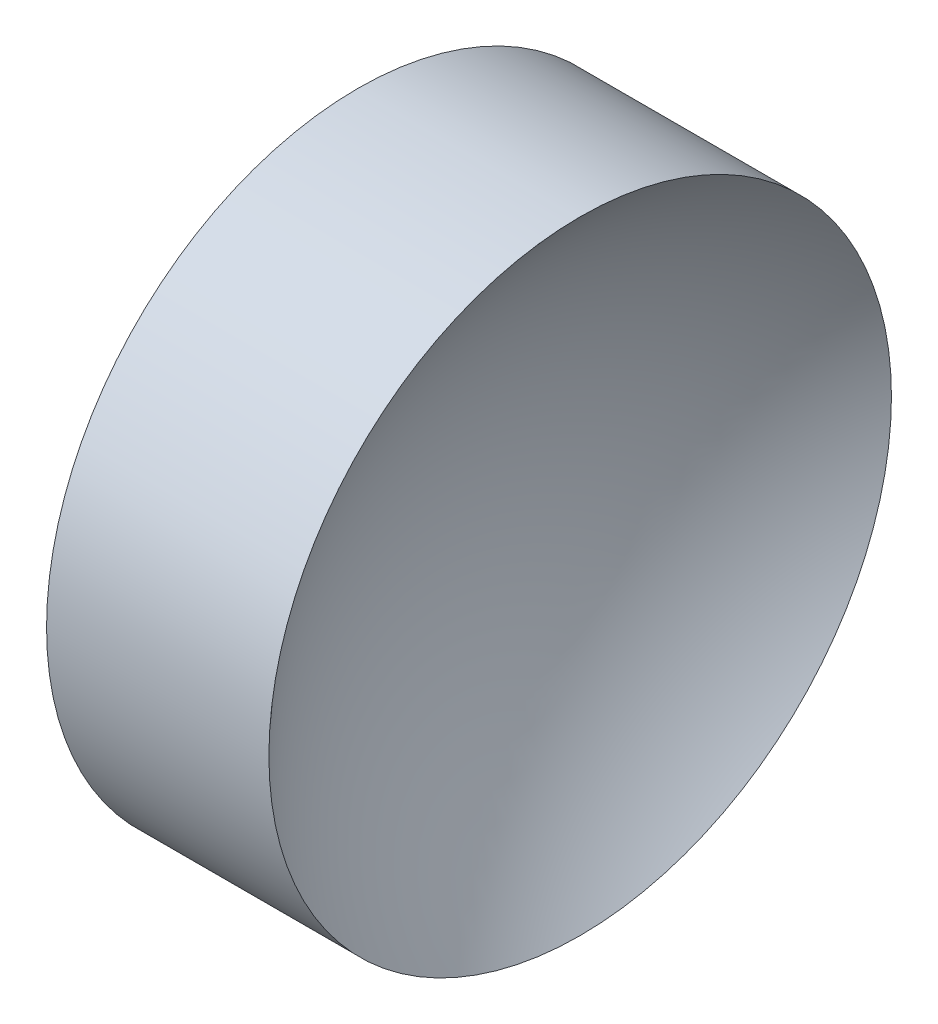
ISO-10303-21;
HEADER;
FILE_DESCRIPTION(('STEP AP214'),'2;1');
FILE_NAME('part.step','',(''),(''),'','','');
FILE_SCHEMA(('AUTOMOTIVE_DESIGN { 1 0 10303 214 1 1 1 1 }'));
ENDSEC;
DATA;
#1=APPLICATION_CONTEXT('core data for automotive mechanical design processes');
#2=APPLICATION_PROTOCOL_DEFINITION('international standard','automotive_design',2000,#1);
#3=PRODUCT_CONTEXT('',#1,'mechanical');
#4=PRODUCT('Part','Part','',(#3));
#5=PRODUCT_RELATED_PRODUCT_CATEGORY('part','',(#4));
#6=PRODUCT_DEFINITION_FORMATION('','',#4);
#7=PRODUCT_DEFINITION_CONTEXT('part definition',#1,'design');
#8=PRODUCT_DEFINITION('design','',#6,#7);
#9=PRODUCT_DEFINITION_SHAPE('','',#8);
#10=(LENGTH_UNIT() NAMED_UNIT(*) SI_UNIT(.MILLI.,.METRE.));
#11=(NAMED_UNIT(*) PLANE_ANGLE_UNIT() SI_UNIT($,.RADIAN.));
#12=(NAMED_UNIT(*) SI_UNIT($,.STERADIAN.) SOLID_ANGLE_UNIT());
#13=UNCERTAINTY_MEASURE_WITH_UNIT(LENGTH_MEASURE(1.E-05),#10,'distance_accuracy_value','');
#14=(GEOMETRIC_REPRESENTATION_CONTEXT(3) GLOBAL_UNCERTAINTY_ASSIGNED_CONTEXT((#13)) GLOBAL_UNIT_ASSIGNED_CONTEXT((#10,
#11,#12)) REPRESENTATION_CONTEXT('',''));
#15=CARTESIAN_POINT('',(0.,0.,0.));
#16=DIRECTION('',(0.,0.,1.));
#17=DIRECTION('',(1.,0.,0.));
#18=AXIS2_PLACEMENT_3D('',#15,#16,#17);
#19=CARTESIAN_POINT('',(27.7948754892866,13.031126091403,0.));
#20=DIRECTION('',(-1.,0.,0.));
#21=DIRECTION('',(0.,-1.,0.));
#22=AXIS2_PLACEMENT_3D('',#19,#20,#21);
#23=SPHERICAL_SURFACE('',#22,4.594);
#24=CARTESIAN_POINT('',(24.4508754892866,13.031126091403,0.));
#25=DIRECTION('',(-1.,0.,0.));
#26=DIRECTION('',(0.,0.,1.));
#27=AXIS2_PLACEMENT_3D('',#24,#25,#26);
#28=CIRCLE('',#27,3.15);
#29=CARTESIAN_POINT('',(24.4508754892866,13.031126091403,3.15));
#30=VERTEX_POINT('',#29);
#31=EDGE_CURVE('E10',#30,#30,#28,.T.);
#32=ORIENTED_EDGE('',*,*,#31,.F.);
#33=EDGE_LOOP('',(#32));
#34=FACE_BOUND('',#33,.T.);
#35=ADVANCED_FACE('F35',(#34),#23,.F.);
#36=CARTESIAN_POINT('',(21.1564719224443,13.031126091403,0.));
#37=DIRECTION('',(-1.,0.,0.));
#38=DIRECTION('',(0.,0.,1.));
#39=AXIS2_PLACEMENT_3D('',#36,#37,#38);
#40=CYLINDRICAL_SURFACE('',#39,3.15);
#41=CARTESIAN_POINT('',(22.2008754892866,13.031126091403,0.));
#42=DIRECTION('',(-1.,0.,0.));
#43=DIRECTION('',(0.,0.,1.));
#44=AXIS2_PLACEMENT_3D('',#41,#42,#43);
#45=CIRCLE('',#44,3.15);
#46=CARTESIAN_POINT('',(22.2008754892866,13.031126091403,3.15));
#47=VERTEX_POINT('',#46);
#48=EDGE_CURVE('E41',#47,#47,#45,.T.);
#49=ORIENTED_EDGE('',*,*,#48,.F.);
#50=EDGE_LOOP('',(#49));
#51=FACE_BOUND('',#50,.T.);
#52=ORIENTED_EDGE('',*,*,#31,.T.);
#53=EDGE_LOOP('',(#52));
#54=FACE_BOUND('',#53,.T.);
#55=ADVANCED_FACE('F49',(#51,#54),#40,.T.);
#56=CARTESIAN_POINT('',(22.2008754892866,13.031126091403,0.));
#57=DIRECTION('',(1.,0.,0.));
#58=DIRECTION('',(0.,0.,-1.));
#59=AXIS2_PLACEMENT_3D('',#56,#57,#58);
#60=PLANE('',#59);
#61=ORIENTED_EDGE('',*,*,#48,.T.);
#62=EDGE_LOOP('',(#61));
#63=FACE_BOUND('',#62,.T.);
#64=ADVANCED_FACE('F47',(#63),#60,.F.);
#65=CLOSED_SHELL('',(#35,#55,#64));
#66=MANIFOLD_SOLID_BREP('B2',#65);
#67=ADVANCED_BREP_SHAPE_REPRESENTATION('',(#18,#66),#14);
#68=SHAPE_DEFINITION_REPRESENTATION(#9,#67);
ENDSEC;
END-ISO-10303-21;
